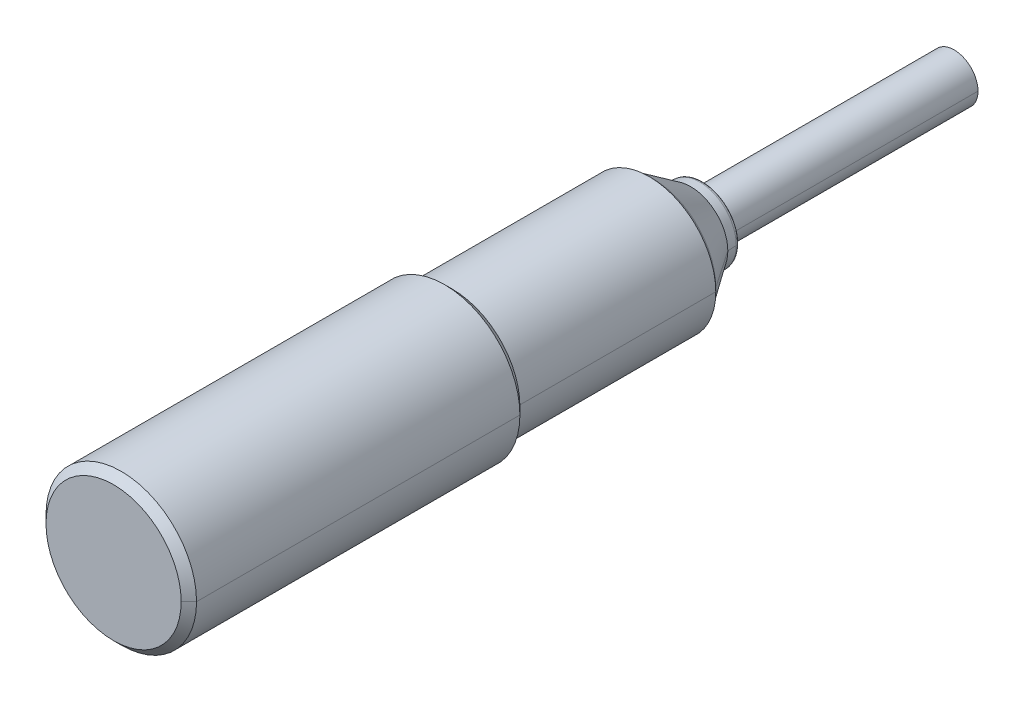
ISO-10303-21;
HEADER;
FILE_DESCRIPTION(('STEP AP214'),'2;1');
FILE_NAME('part.step','',(''),(''),'','','');
FILE_SCHEMA(('AUTOMOTIVE_DESIGN { 1 0 10303 214 1 1 1 1 }'));
ENDSEC;
DATA;
#1=APPLICATION_CONTEXT('core data for automotive mechanical design processes');
#2=APPLICATION_PROTOCOL_DEFINITION('international standard','automotive_design',2000,#1);
#3=PRODUCT_CONTEXT('',#1,'mechanical');
#4=PRODUCT('Part','Part','',(#3));
#5=PRODUCT_RELATED_PRODUCT_CATEGORY('part','',(#4));
#6=PRODUCT_DEFINITION_FORMATION('','',#4);
#7=PRODUCT_DEFINITION_CONTEXT('part definition',#1,'design');
#8=PRODUCT_DEFINITION('design','',#6,#7);
#9=PRODUCT_DEFINITION_SHAPE('','',#8);
#10=(LENGTH_UNIT() NAMED_UNIT(*) SI_UNIT(.MILLI.,.METRE.));
#11=(NAMED_UNIT(*) PLANE_ANGLE_UNIT() SI_UNIT($,.RADIAN.));
#12=(NAMED_UNIT(*) SI_UNIT($,.STERADIAN.) SOLID_ANGLE_UNIT());
#13=UNCERTAINTY_MEASURE_WITH_UNIT(LENGTH_MEASURE(1.E-05),#10,'distance_accuracy_value','');
#14=(GEOMETRIC_REPRESENTATION_CONTEXT(3) GLOBAL_UNCERTAINTY_ASSIGNED_CONTEXT((#13)) GLOBAL_UNIT_ASSIGNED_CONTEXT((#10,
#11,#12)) REPRESENTATION_CONTEXT('',''));
#15=CARTESIAN_POINT('',(0.,0.,0.));
#16=DIRECTION('',(0.,0.,1.));
#17=DIRECTION('',(1.,0.,0.));
#18=AXIS2_PLACEMENT_3D('',#15,#16,#17);
#19=CARTESIAN_POINT('',(0.,0.,0.));
#20=DIRECTION('',(0.,0.,-1.));
#21=DIRECTION('',(-1.,0.,0.));
#22=AXIS2_PLACEMENT_3D('',#19,#20,#21);
#23=PLANE('',#22);
#24=CARTESIAN_POINT('',(0.,0.,0.));
#25=DIRECTION('',(0.,0.,-1.));
#26=DIRECTION('',(-1.,0.,0.));
#27=AXIS2_PLACEMENT_3D('',#24,#25,#26);
#28=CIRCLE('',#27,5.3865);
#29=CARTESIAN_POINT('',(5.3865,0.,0.));
#30=VERTEX_POINT('',#29);
#31=CARTESIAN_POINT('',(-5.3865,0.,0.));
#32=VERTEX_POINT('',#31);
#33=EDGE_CURVE('E10',#30,#32,#28,.T.);
#34=ORIENTED_EDGE('',*,*,#33,.F.);
#35=CARTESIAN_POINT('',(0.,0.,0.));
#36=DIRECTION('',(0.,0.,-1.));
#37=DIRECTION('',(-1.,0.,0.));
#38=AXIS2_PLACEMENT_3D('',#35,#36,#37);
#39=CIRCLE('',#38,5.3865);
#40=EDGE_CURVE('E24',#32,#30,#39,.T.);
#41=ORIENTED_EDGE('',*,*,#40,.F.);
#42=EDGE_LOOP('',(#34,#41));
#43=FACE_BOUND('',#42,.T.);
#44=ADVANCED_FACE('F16',(#43),#23,.F.);
#45=CARTESIAN_POINT('',(0.,0.,0.));
#46=DIRECTION('',(0.,0.,-1.));
#47=DIRECTION('',(0.,-1.,0.));
#48=AXIS2_PLACEMENT_3D('',#45,#46,#47);
#49=CONICAL_SURFACE('',#48,5.3865,0.785398163397446);
#50=DIRECTION('',(0.707106781186546,0.,-0.707106781186549));
#51=VECTOR('',#50,1.);
#52=CARTESIAN_POINT('',(5.3865,0.,0.));
#53=LINE('',#52,#51);
#54=CARTESIAN_POINT('',(6.,0.,-0.6135));
#55=VERTEX_POINT('',#54);
#56=EDGE_CURVE('E342',#30,#55,#53,.T.);
#57=ORIENTED_EDGE('',*,*,#56,.T.);
#58=CARTESIAN_POINT('',(0.,0.,-0.6135));
#59=DIRECTION('',(0.,0.,-1.));
#60=DIRECTION('',(-1.,0.,0.));
#61=AXIS2_PLACEMENT_3D('',#58,#59,#60);
#62=CIRCLE('',#61,6.);
#63=CARTESIAN_POINT('',(-6.,0.,-0.6135));
#64=VERTEX_POINT('',#63);
#65=EDGE_CURVE('E337',#64,#55,#62,.T.);
#66=ORIENTED_EDGE('',*,*,#65,.F.);
#67=DIRECTION('',(-0.707106781186546,0.,-0.707106781186549));
#68=VECTOR('',#67,1.);
#69=CARTESIAN_POINT('',(-5.3865,0.,0.));
#70=LINE('',#69,#68);
#71=EDGE_CURVE('E332',#32,#64,#70,.T.);
#72=ORIENTED_EDGE('',*,*,#71,.F.);
#73=ORIENTED_EDGE('',*,*,#40,.T.);
#74=EDGE_LOOP('',(#57,#66,#72,#73));
#75=FACE_BOUND('',#74,.T.);
#76=ADVANCED_FACE('F351',(#75),#49,.T.);
#77=CARTESIAN_POINT('',(0.,0.,0.));
#78=DIRECTION('',(0.,0.,-1.));
#79=DIRECTION('',(0.,1.,0.));
#80=AXIS2_PLACEMENT_3D('',#77,#78,#79);
#81=CONICAL_SURFACE('',#80,5.3865,0.785398163397446);
#82=ORIENTED_EDGE('',*,*,#56,.F.);
#83=ORIENTED_EDGE('',*,*,#33,.T.);
#84=ORIENTED_EDGE('',*,*,#71,.T.);
#85=CARTESIAN_POINT('',(0.,0.,-0.6135));
#86=DIRECTION('',(0.,0.,-1.));
#87=DIRECTION('',(-1.,0.,0.));
#88=AXIS2_PLACEMENT_3D('',#85,#86,#87);
#89=CIRCLE('',#88,6.);
#90=EDGE_CURVE('E327',#55,#64,#89,.T.);
#91=ORIENTED_EDGE('',*,*,#90,.F.);
#92=EDGE_LOOP('',(#82,#83,#84,#91));
#93=FACE_BOUND('',#92,.T.);
#94=ADVANCED_FACE('F354',(#93),#81,.T.);
#95=CARTESIAN_POINT('',(0.,0.,-67.));
#96=DIRECTION('',(0.,0.,-1.));
#97=DIRECTION('',(0.,1.,0.));
#98=AXIS2_PLACEMENT_3D('',#95,#96,#97);
#99=CYLINDRICAL_SURFACE('',#98,6.);
#100=DIRECTION('',(0.,0.,-1.));
#101=VECTOR('',#100,1.);
#102=CARTESIAN_POINT('',(6.,0.,-0.613500000000002));
#103=LINE('',#102,#101);
#104=CARTESIAN_POINT('',(6.,0.,-26.3865));
#105=VERTEX_POINT('',#104);
#106=EDGE_CURVE('E322',#55,#105,#103,.T.);
#107=ORIENTED_EDGE('',*,*,#106,.F.);
#108=ORIENTED_EDGE('',*,*,#90,.T.);
#109=DIRECTION('',(0.,0.,-1.));
#110=VECTOR('',#109,1.);
#111=CARTESIAN_POINT('',(-6.,0.,-0.613500000000002));
#112=LINE('',#111,#110);
#113=CARTESIAN_POINT('',(-6.,0.,-26.3865));
#114=VERTEX_POINT('',#113);
#115=EDGE_CURVE('E318',#64,#114,#112,.T.);
#116=ORIENTED_EDGE('',*,*,#115,.T.);
#117=CARTESIAN_POINT('',(0.,0.,-26.3865));
#118=DIRECTION('',(0.,0.,-1.));
#119=DIRECTION('',(-1.,0.,0.));
#120=AXIS2_PLACEMENT_3D('',#117,#118,#119);
#121=CIRCLE('',#120,6.);
#122=EDGE_CURVE('E313',#105,#114,#121,.T.);
#123=ORIENTED_EDGE('',*,*,#122,.F.);
#124=EDGE_LOOP('',(#107,#108,#116,#123));
#125=FACE_BOUND('',#124,.T.);
#126=ADVANCED_FACE('F358',(#125),#99,.T.);
#127=CARTESIAN_POINT('',(0.,0.,-26.3865));
#128=DIRECTION('',(0.,0.,1.));
#129=DIRECTION('',(0.,1.,0.));
#130=AXIS2_PLACEMENT_3D('',#127,#128,#129);
#131=CONICAL_SURFACE('',#130,6.,0.785398163397457);
#132=DIRECTION('',(-0.707106781186554,0.,0.707106781186541));
#133=VECTOR('',#132,1.);
#134=CARTESIAN_POINT('',(-5.38649999999999,0.,-27.));
#135=LINE('',#134,#133);
#136=CARTESIAN_POINT('',(-5.3865,0.,-27.));
#137=VERTEX_POINT('',#136);
#138=EDGE_CURVE('E308',#137,#114,#135,.T.);
#139=ORIENTED_EDGE('',*,*,#138,.F.);
#140=CARTESIAN_POINT('',(0.,0.,-27.));
#141=DIRECTION('',(0.,0.,-1.));
#142=DIRECTION('',(-1.,0.,0.));
#143=AXIS2_PLACEMENT_3D('',#140,#141,#142);
#144=CIRCLE('',#143,5.3865);
#145=CARTESIAN_POINT('',(5.38649999999999,0.,-27.));
#146=VERTEX_POINT('',#145);
#147=EDGE_CURVE('E303',#146,#137,#144,.T.);
#148=ORIENTED_EDGE('',*,*,#147,.F.);
#149=DIRECTION('',(0.707106781186554,0.,0.707106781186541));
#150=VECTOR('',#149,1.);
#151=CARTESIAN_POINT('',(5.38649999999999,0.,-27.));
#152=LINE('',#151,#150);
#153=EDGE_CURVE('E298',#146,#105,#152,.T.);
#154=ORIENTED_EDGE('',*,*,#153,.T.);
#155=ORIENTED_EDGE('',*,*,#122,.T.);
#156=EDGE_LOOP('',(#139,#148,#154,#155));
#157=FACE_BOUND('',#156,.T.);
#158=ADVANCED_FACE('F367',(#157),#131,.T.);
#159=CARTESIAN_POINT('',(0.,0.,-26.3865));
#160=DIRECTION('',(0.,0.,1.));
#161=DIRECTION('',(0.,-1.,0.));
#162=AXIS2_PLACEMENT_3D('',#159,#160,#161);
#163=CONICAL_SURFACE('',#162,6.,0.785398163397457);
#164=ORIENTED_EDGE('',*,*,#138,.T.);
#165=CARTESIAN_POINT('',(0.,0.,-26.3865));
#166=DIRECTION('',(0.,0.,-1.));
#167=DIRECTION('',(-1.,0.,0.));
#168=AXIS2_PLACEMENT_3D('',#165,#166,#167);
#169=CIRCLE('',#168,6.);
#170=EDGE_CURVE('E293',#114,#105,#169,.T.);
#171=ORIENTED_EDGE('',*,*,#170,.T.);
#172=ORIENTED_EDGE('',*,*,#153,.F.);
#173=CARTESIAN_POINT('',(0.,0.,-27.));
#174=DIRECTION('',(0.,0.,-1.));
#175=DIRECTION('',(-1.,0.,0.));
#176=AXIS2_PLACEMENT_3D('',#173,#174,#175);
#177=CIRCLE('',#176,5.3865);
#178=EDGE_CURVE('E288',#137,#146,#177,.T.);
#179=ORIENTED_EDGE('',*,*,#178,.F.);
#180=EDGE_LOOP('',(#164,#171,#172,#179));
#181=FACE_BOUND('',#180,.T.);
#182=ADVANCED_FACE('F365',(#181),#163,.T.);
#183=CARTESIAN_POINT('',(0.,5.3865,-27.));
#184=DIRECTION('',(0.,0.,1.));
#185=DIRECTION('',(1.,0.,0.));
#186=AXIS2_PLACEMENT_3D('',#183,#184,#185);
#187=PLANE('',#186);
#188=CARTESIAN_POINT('',(0.,0.,-27.));
#189=DIRECTION('',(0.,0.,-1.));
#190=DIRECTION('',(-1.,0.,0.));
#191=AXIS2_PLACEMENT_3D('',#188,#189,#190);
#192=CIRCLE('',#191,5.3);
#193=CARTESIAN_POINT('',(5.3,0.,-27.));
#194=VERTEX_POINT('',#193);
#195=CARTESIAN_POINT('',(-5.3,0.,-27.));
#196=VERTEX_POINT('',#195);
#197=EDGE_CURVE('E283',#194,#196,#192,.T.);
#198=ORIENTED_EDGE('',*,*,#197,.F.);
#199=CARTESIAN_POINT('',(0.,0.,-27.));
#200=DIRECTION('',(0.,0.,-1.));
#201=DIRECTION('',(-1.,0.,0.));
#202=AXIS2_PLACEMENT_3D('',#199,#200,#201);
#203=CIRCLE('',#202,5.3);
#204=EDGE_CURVE('E278',#196,#194,#203,.T.);
#205=ORIENTED_EDGE('',*,*,#204,.F.);
#206=EDGE_LOOP('',(#198,#205));
#207=FACE_BOUND('',#206,.T.);
#208=ORIENTED_EDGE('',*,*,#178,.T.);
#209=ORIENTED_EDGE('',*,*,#147,.T.);
#210=EDGE_LOOP('',(#208,#209));
#211=FACE_BOUND('',#210,.T.);
#212=ADVANCED_FACE('F369',(#207,#211),#187,.F.);
#213=CARTESIAN_POINT('',(0.,0.,-67.));
#214=DIRECTION('',(0.,0.,-1.));
#215=DIRECTION('',(0.,-1.,0.));
#216=AXIS2_PLACEMENT_3D('',#213,#214,#215);
#217=CYLINDRICAL_SURFACE('',#216,5.3);
#218=DIRECTION('',(0.,0.,-1.));
#219=VECTOR('',#218,1.);
#220=CARTESIAN_POINT('',(5.3,0.,-27.));
#221=LINE('',#220,#219);
#222=CARTESIAN_POINT('',(5.3,0.,-42.7));
#223=VERTEX_POINT('',#222);
#224=EDGE_CURVE('E274',#194,#223,#221,.T.);
#225=ORIENTED_EDGE('',*,*,#224,.T.);
#226=CARTESIAN_POINT('',(0.,0.,-42.7));
#227=DIRECTION('',(0.,0.,-1.));
#228=DIRECTION('',(-1.,0.,0.));
#229=AXIS2_PLACEMENT_3D('',#226,#227,#228);
#230=CIRCLE('',#229,5.3);
#231=CARTESIAN_POINT('',(-5.3,0.,-42.7));
#232=VERTEX_POINT('',#231);
#233=EDGE_CURVE('E269',#232,#223,#230,.T.);
#234=ORIENTED_EDGE('',*,*,#233,.F.);
#235=DIRECTION('',(0.,0.,-1.));
#236=VECTOR('',#235,1.);
#237=CARTESIAN_POINT('',(-5.3,0.,-27.));
#238=LINE('',#237,#236);
#239=EDGE_CURVE('E264',#196,#232,#238,.T.);
#240=ORIENTED_EDGE('',*,*,#239,.F.);
#241=ORIENTED_EDGE('',*,*,#204,.T.);
#242=EDGE_LOOP('',(#225,#234,#240,#241));
#243=FACE_BOUND('',#242,.T.);
#244=ADVANCED_FACE('F371',(#243),#217,.T.);
#245=CARTESIAN_POINT('',(0.,0.,-67.));
#246=DIRECTION('',(0.,0.,-1.));
#247=DIRECTION('',(0.,1.,0.));
#248=AXIS2_PLACEMENT_3D('',#245,#246,#247);
#249=CYLINDRICAL_SURFACE('',#248,5.3);
#250=ORIENTED_EDGE('',*,*,#224,.F.);
#251=ORIENTED_EDGE('',*,*,#197,.T.);
#252=ORIENTED_EDGE('',*,*,#239,.T.);
#253=CARTESIAN_POINT('',(0.,0.,-42.7));
#254=DIRECTION('',(0.,0.,-1.));
#255=DIRECTION('',(-1.,0.,0.));
#256=AXIS2_PLACEMENT_3D('',#253,#254,#255);
#257=CIRCLE('',#256,5.3);
#258=EDGE_CURVE('E259',#223,#232,#257,.T.);
#259=ORIENTED_EDGE('',*,*,#258,.F.);
#260=EDGE_LOOP('',(#250,#251,#252,#259));
#261=FACE_BOUND('',#260,.T.);
#262=ADVANCED_FACE('F379',(#261),#249,.T.);
#263=CARTESIAN_POINT('',(0.,0.,-42.7));
#264=DIRECTION('',(0.,0.,1.));
#265=DIRECTION('',(0.,1.,0.));
#266=AXIS2_PLACEMENT_3D('',#263,#264,#265);
#267=CONICAL_SURFACE('',#266,5.3,0.785398163397446);
#268=DIRECTION('',(-0.707106781186548,0.,0.707106781186548));
#269=VECTOR('',#268,1.);
#270=CARTESIAN_POINT('',(-5.,0.,-43.));
#271=LINE('',#270,#269);
#272=CARTESIAN_POINT('',(-5.,0.,-43.));
#273=VERTEX_POINT('',#272);
#274=EDGE_CURVE('E254',#273,#232,#271,.T.);
#275=ORIENTED_EDGE('',*,*,#274,.F.);
#276=CARTESIAN_POINT('',(0.,0.,-43.));
#277=DIRECTION('',(0.,0.,-1.));
#278=DIRECTION('',(-1.,0.,0.));
#279=AXIS2_PLACEMENT_3D('',#276,#277,#278);
#280=CIRCLE('',#279,5.);
#281=CARTESIAN_POINT('',(5.,0.,-43.));
#282=VERTEX_POINT('',#281);
#283=EDGE_CURVE('E249',#282,#273,#280,.T.);
#284=ORIENTED_EDGE('',*,*,#283,.F.);
#285=DIRECTION('',(0.707106781186548,0.,0.707106781186548));
#286=VECTOR('',#285,1.);
#287=CARTESIAN_POINT('',(5.,0.,-43.));
#288=LINE('',#287,#286);
#289=EDGE_CURVE('E244',#282,#223,#288,.T.);
#290=ORIENTED_EDGE('',*,*,#289,.T.);
#291=ORIENTED_EDGE('',*,*,#258,.T.);
#292=EDGE_LOOP('',(#275,#284,#290,#291));
#293=FACE_BOUND('',#292,.T.);
#294=ADVANCED_FACE('F427',(#293),#267,.T.);
#295=CARTESIAN_POINT('',(0.,0.,-42.7));
#296=DIRECTION('',(0.,0.,1.));
#297=DIRECTION('',(0.,-1.,0.));
#298=AXIS2_PLACEMENT_3D('',#295,#296,#297);
#299=CONICAL_SURFACE('',#298,5.3,0.785398163397446);
#300=ORIENTED_EDGE('',*,*,#274,.T.);
#301=ORIENTED_EDGE('',*,*,#233,.T.);
#302=ORIENTED_EDGE('',*,*,#289,.F.);
#303=CARTESIAN_POINT('',(0.,0.,-43.));
#304=DIRECTION('',(0.,0.,-1.));
#305=DIRECTION('',(-1.,0.,0.));
#306=AXIS2_PLACEMENT_3D('',#303,#304,#305);
#307=CIRCLE('',#306,5.);
#308=EDGE_CURVE('E239',#273,#282,#307,.T.);
#309=ORIENTED_EDGE('',*,*,#308,.F.);
#310=EDGE_LOOP('',(#300,#301,#302,#309));
#311=FACE_BOUND('',#310,.T.);
#312=ADVANCED_FACE('F437',(#311),#299,.T.);
#313=CARTESIAN_POINT('',(0.,0.,-43.));
#314=DIRECTION('',(0.,0.,1.));
#315=DIRECTION('',(0.,-1.,0.));
#316=AXIS2_PLACEMENT_3D('',#313,#314,#315);
#317=CONICAL_SURFACE('',#316,5.,0.597251670032467);
#318=DIRECTION('',(-0.562372049186204,0.,0.826884319777627));
#319=VECTOR('',#318,1.);
#320=CARTESIAN_POINT('',(-2.9596708908299,0.,-46.));
#321=LINE('',#320,#319);
#322=CARTESIAN_POINT('',(-2.9596708908299,0.,-46.));
#323=VERTEX_POINT('',#322);
#324=EDGE_CURVE('E234',#323,#273,#321,.T.);
#325=ORIENTED_EDGE('',*,*,#324,.T.);
#326=ORIENTED_EDGE('',*,*,#308,.T.);
#327=DIRECTION('',(0.562372049186204,0.,0.826884319777627));
#328=VECTOR('',#327,1.);
#329=CARTESIAN_POINT('',(2.9596708908299,0.,-46.));
#330=LINE('',#329,#328);
#331=CARTESIAN_POINT('',(2.9596708908299,0.,-46.));
#332=VERTEX_POINT('',#331);
#333=EDGE_CURVE('E229',#332,#282,#330,.T.);
#334=ORIENTED_EDGE('',*,*,#333,.F.);
#335=CARTESIAN_POINT('',(0.,0.,-46.));
#336=DIRECTION('',(0.,0.,-1.));
#337=DIRECTION('',(-1.,0.,0.));
#338=AXIS2_PLACEMENT_3D('',#335,#336,#337);
#339=CIRCLE('',#338,2.9596708908299);
#340=EDGE_CURVE('E224',#323,#332,#339,.T.);
#341=ORIENTED_EDGE('',*,*,#340,.F.);
#342=EDGE_LOOP('',(#325,#326,#334,#341));
#343=FACE_BOUND('',#342,.T.);
#344=ADVANCED_FACE('F447',(#343),#317,.T.);
#345=CARTESIAN_POINT('',(0.,0.,-46.));
#346=DIRECTION('',(0.,0.,1.));
#347=DIRECTION('',(0.,-1.,0.));
#348=AXIS2_PLACEMENT_3D('',#345,#346,#347);
#349=CONICAL_SURFACE('',#348,2.9596708908299,0.0596002200534987);
#350=DIRECTION('',(-0.0595649411397777,0.,0.998224432573665));
#351=VECTOR('',#350,1.);
#352=CARTESIAN_POINT('',(-2.916834979319,0.,-46.717869482342));
#353=LINE('',#352,#351);
#354=CARTESIAN_POINT('',(-2.916834979319,0.,-46.717869482342));
#355=VERTEX_POINT('',#354);
#356=EDGE_CURVE('E219',#355,#323,#353,.T.);
#357=ORIENTED_EDGE('',*,*,#356,.T.);
#358=ORIENTED_EDGE('',*,*,#340,.T.);
#359=DIRECTION('',(0.0595649411397777,0.,0.998224432573665));
#360=VECTOR('',#359,1.);
#361=CARTESIAN_POINT('',(2.916834979319,0.,-46.717869482342));
#362=LINE('',#361,#360);
#363=CARTESIAN_POINT('',(2.916834979319,0.,-46.717869482342));
#364=VERTEX_POINT('',#363);
#365=EDGE_CURVE('E214',#364,#332,#362,.T.);
#366=ORIENTED_EDGE('',*,*,#365,.F.);
#367=CARTESIAN_POINT('',(0.,0.,-46.717869482342));
#368=DIRECTION('',(0.,0.,-1.));
#369=DIRECTION('',(-1.,0.,0.));
#370=AXIS2_PLACEMENT_3D('',#367,#368,#369);
#371=CIRCLE('',#370,2.916834979319);
#372=CARTESIAN_POINT('',(0.901351578396863,2.77407491403895,-46.717869482342));
#373=VERTEX_POINT('',#372);
#374=EDGE_CURVE('E209',#373,#364,#371,.T.);
#375=ORIENTED_EDGE('',*,*,#374,.F.);
#376=CARTESIAN_POINT('',(0.,0.,-46.717869482342));
#377=DIRECTION('',(0.,0.,-1.));
#378=DIRECTION('',(-1.,0.,0.));
#379=AXIS2_PLACEMENT_3D('',#376,#377,#378);
#380=CIRCLE('',#379,2.916834979319);
#381=EDGE_CURVE('E204',#355,#373,#380,.T.);
#382=ORIENTED_EDGE('',*,*,#381,.F.);
#383=EDGE_LOOP('',(#357,#358,#366,#375,#382));
#384=FACE_BOUND('',#383,.T.);
#385=ADVANCED_FACE('F175',(#384),#349,.T.);
#386=CARTESIAN_POINT('',(0.,0.,-46.7));
#387=DIRECTION('',(0.,0.,-1.));
#388=DIRECTION('',(0.951056516295154,-0.309016994374947,0.));
#389=AXIS2_PLACEMENT_3D('',#386,#387,#388);
#390=TOROIDAL_SURFACE('',#389,2.61736764954721,0.29999999999967);
#391=CARTESIAN_POINT('',(-0.808811084237301,-2.48926455864201,-46.7));
#392=DIRECTION('',(-0.951056516295154,0.309016994374947,0.));
#393=DIRECTION('',(0.,0.,-1.));
#394=AXIS2_PLACEMENT_3D('',#391,#392,#393);
#395=CIRCLE('',#394,0.29999999999967);
#396=CARTESIAN_POINT('',(-0.808811084237301,-2.48926455864201,-46.9999999999997));
#397=VERTEX_POINT('',#396);
#398=CARTESIAN_POINT('',(-0.901351578396862,-2.77407491403895,-46.717869482342));
#399=VERTEX_POINT('',#398);
#400=EDGE_CURVE('E200',#397,#399,#395,.T.);
#401=ORIENTED_EDGE('',*,*,#400,.T.);
#402=CARTESIAN_POINT('',(0.,0.,-46.717869482342));
#403=DIRECTION('',(0.,0.,-1.));
#404=DIRECTION('',(-1.,0.,0.));
#405=AXIS2_PLACEMENT_3D('',#402,#403,#404);
#406=CIRCLE('',#405,2.916834979319);
#407=EDGE_CURVE('E195',#399,#355,#406,.T.);
#408=ORIENTED_EDGE('',*,*,#407,.T.);
#409=ORIENTED_EDGE('',*,*,#381,.T.);
#410=CARTESIAN_POINT('',(0.808811084237301,2.48926455864201,-46.7));
#411=DIRECTION('',(0.951056516295154,-0.309016994374947,0.));
#412=DIRECTION('',(0.,0.,-1.));
#413=AXIS2_PLACEMENT_3D('',#410,#411,#412);
#414=CIRCLE('',#413,0.29999999999967);
#415=CARTESIAN_POINT('',(0.808811084237301,2.48926455864201,-46.9999999999997));
#416=VERTEX_POINT('',#415);
#417=EDGE_CURVE('E192',#416,#373,#414,.T.);
#418=ORIENTED_EDGE('',*,*,#417,.F.);
#419=CARTESIAN_POINT('',(-0.808811084237203,-2.48926455864171,-47.));
#420=CARTESIAN_POINT('',(-1.59048885550696,-2.23493089535044,-47.));
#421=CARTESIAN_POINT('',(-2.27452528969776,-1.67500414516168,-47.));
#422=CARTESIAN_POINT('',(-2.69121829726129,-0.855110234126054,-47.));
#423=CARTESIAN_POINT('',(-2.795609891976,0.908348716886556,-47.));
#424=CARTESIAN_POINT('',(-1.67462015335354,2.27365713730176,-47.));
#425=CARTESIAN_POINT('',(-0.85558687944629,2.69203924033491,-47.));
#426=CARTESIAN_POINT('',(0.0269269067107043,2.74296296879463,-47.));
#427=CARTESIAN_POINT('',(0.808811084237203,2.48926455864171,-47.));
#428=B_SPLINE_CURVE_WITH_KNOTS('',5,(#419,#420,#421,#422,#423,#424,#425,#426,#427),
.UNSPECIFIED.,.F.,.F.,(6,3,6),(0.,1.5707963267949,3.14159265358979),.UNSPECIFIED.);
#429=EDGE_CURVE('E191',#397,#416,#428,.T.);
#430=ORIENTED_EDGE('',*,*,#429,.F.);
#431=EDGE_LOOP('',(#401,#408,#409,#418,#430));
#432=FACE_BOUND('',#431,.T.);
#433=ADVANCED_FACE('F169',(#432),#390,.T.);
#434=CARTESIAN_POINT('',(0.,2.6173676495469,-47.));
#435=DIRECTION('',(0.,0.,1.));
#436=DIRECTION('',(1.,0.,0.));
#437=AXIS2_PLACEMENT_3D('',#434,#435,#436);
#438=PLANE('',#437);
#439=CARTESIAN_POINT('',(0.,0.,-47.));
#440=DIRECTION('',(0.,0.,-1.));
#441=DIRECTION('',(-1.,0.,0.));
#442=AXIS2_PLACEMENT_3D('',#439,#440,#441);
#443=CIRCLE('',#442,1.9);
#444=CARTESIAN_POINT('',(1.9,0.,-47.));
#445=VERTEX_POINT('',#444);
#446=CARTESIAN_POINT('',(-1.9,0.,-47.));
#447=VERTEX_POINT('',#446);
#448=EDGE_CURVE('E122',#445,#447,#443,.T.);
#449=ORIENTED_EDGE('',*,*,#448,.F.);
#450=CARTESIAN_POINT('',(0.,0.,-47.));
#451=DIRECTION('',(0.,0.,-1.));
#452=DIRECTION('',(-1.,0.,0.));
#453=AXIS2_PLACEMENT_3D('',#450,#451,#452);
#454=CIRCLE('',#453,1.9);
#455=EDGE_CURVE('E149',#447,#445,#454,.T.);
#456=ORIENTED_EDGE('',*,*,#455,.F.);
#457=EDGE_LOOP('',(#449,#456));
#458=FACE_BOUND('',#457,.T.);
#459=ORIENTED_EDGE('',*,*,#429,.T.);
#460=CARTESIAN_POINT('',(0.,0.,-47.));
#461=DIRECTION('',(0.,0.,-1.));
#462=DIRECTION('',(-1.,0.,0.));
#463=AXIS2_PLACEMENT_3D('',#460,#461,#462);
#464=CIRCLE('',#463,2.6173676495469);
#465=EDGE_CURVE('E144',#416,#397,#464,.T.);
#466=ORIENTED_EDGE('',*,*,#465,.T.);
#467=EDGE_LOOP('',(#459,#466));
#468=FACE_BOUND('',#467,.T.);
#469=ADVANCED_FACE('F158',(#458,#468),#438,.F.);
#470=CARTESIAN_POINT('',(0.,0.,-46.7));
#471=DIRECTION('',(0.,0.,-1.));
#472=DIRECTION('',(-0.951056516295154,0.309016994374947,0.));
#473=AXIS2_PLACEMENT_3D('',#470,#471,#472);
#474=TOROIDAL_SURFACE('',#473,2.61736764954721,0.29999999999967);
#475=ORIENTED_EDGE('',*,*,#400,.F.);
#476=ORIENTED_EDGE('',*,*,#465,.F.);
#477=ORIENTED_EDGE('',*,*,#417,.T.);
#478=ORIENTED_EDGE('',*,*,#374,.T.);
#479=CARTESIAN_POINT('',(0.,0.,-46.717869482342));
#480=DIRECTION('',(0.,0.,-1.));
#481=DIRECTION('',(-1.,0.,0.));
#482=AXIS2_PLACEMENT_3D('',#479,#480,#481);
#483=CIRCLE('',#482,2.916834979319);
#484=EDGE_CURVE('E139',#364,#399,#483,.T.);
#485=ORIENTED_EDGE('',*,*,#484,.T.);
#486=EDGE_LOOP('',(#475,#476,#477,#478,#485));
#487=FACE_BOUND('',#486,.T.);
#488=ADVANCED_FACE('F168',(#487),#474,.T.);
#489=CARTESIAN_POINT('',(0.,0.,-46.));
#490=DIRECTION('',(0.,0.,1.));
#491=DIRECTION('',(0.,1.,0.));
#492=AXIS2_PLACEMENT_3D('',#489,#490,#491);
#493=CONICAL_SURFACE('',#492,2.9596708908299,0.0596002200534987);
#494=ORIENTED_EDGE('',*,*,#356,.F.);
#495=ORIENTED_EDGE('',*,*,#407,.F.);
#496=ORIENTED_EDGE('',*,*,#484,.F.);
#497=ORIENTED_EDGE('',*,*,#365,.T.);
#498=CARTESIAN_POINT('',(0.,0.,-46.));
#499=DIRECTION('',(0.,0.,-1.));
#500=DIRECTION('',(-1.,0.,0.));
#501=AXIS2_PLACEMENT_3D('',#498,#499,#500);
#502=CIRCLE('',#501,2.9596708908299);
#503=EDGE_CURVE('E134',#332,#323,#502,.T.);
#504=ORIENTED_EDGE('',*,*,#503,.T.);
#505=EDGE_LOOP('',(#494,#495,#496,#497,#504));
#506=FACE_BOUND('',#505,.T.);
#507=ADVANCED_FACE('F485',(#506),#493,.T.);
#508=CARTESIAN_POINT('',(0.,0.,-43.));
#509=DIRECTION('',(0.,0.,1.));
#510=DIRECTION('',(0.,1.,0.));
#511=AXIS2_PLACEMENT_3D('',#508,#509,#510);
#512=CONICAL_SURFACE('',#511,5.,0.597251670032467);
#513=ORIENTED_EDGE('',*,*,#324,.F.);
#514=ORIENTED_EDGE('',*,*,#503,.F.);
#515=ORIENTED_EDGE('',*,*,#333,.T.);
#516=ORIENTED_EDGE('',*,*,#283,.T.);
#517=EDGE_LOOP('',(#513,#514,#515,#516));
#518=FACE_BOUND('',#517,.T.);
#519=ADVANCED_FACE('F494',(#518),#512,.T.);
#520=CARTESIAN_POINT('',(0.,0.,-67.));
#521=DIRECTION('',(0.,0.,-1.));
#522=DIRECTION('',(0.,-1.,0.));
#523=AXIS2_PLACEMENT_3D('',#520,#521,#522);
#524=CYLINDRICAL_SURFACE('',#523,1.9);
#525=DIRECTION('',(0.,0.,-1.));
#526=VECTOR('',#525,1.);
#527=CARTESIAN_POINT('',(1.9,0.,-47.));
#528=LINE('',#527,#526);
#529=CARTESIAN_POINT('',(1.9,0.,-67.));
#530=VERTEX_POINT('',#529);
#531=EDGE_CURVE('E114',#445,#530,#528,.T.);
#532=ORIENTED_EDGE('',*,*,#531,.T.);
#533=CARTESIAN_POINT('',(0.,0.,-67.));
#534=DIRECTION('',(0.,0.,-1.));
#535=DIRECTION('',(-1.,0.,0.));
#536=AXIS2_PLACEMENT_3D('',#533,#534,#535);
#537=CIRCLE('',#536,1.9);
#538=CARTESIAN_POINT('',(-1.9,0.,-67.));
#539=VERTEX_POINT('',#538);
#540=EDGE_CURVE('E107',#539,#530,#537,.T.);
#541=ORIENTED_EDGE('',*,*,#540,.F.);
#542=DIRECTION('',(0.,0.,-1.));
#543=VECTOR('',#542,1.);
#544=CARTESIAN_POINT('',(-1.9,0.,-47.));
#545=LINE('',#544,#543);
#546=EDGE_CURVE('E111',#447,#539,#545,.T.);
#547=ORIENTED_EDGE('',*,*,#546,.F.);
#548=ORIENTED_EDGE('',*,*,#455,.T.);
#549=EDGE_LOOP('',(#532,#541,#547,#548));
#550=FACE_BOUND('',#549,.T.);
#551=ADVANCED_FACE('F109',(#550),#524,.T.);
#552=CARTESIAN_POINT('',(0.,0.,-67.));
#553=DIRECTION('',(0.,0.,-1.));
#554=DIRECTION('',(0.,1.,0.));
#555=AXIS2_PLACEMENT_3D('',#552,#553,#554);
#556=CYLINDRICAL_SURFACE('',#555,1.9);
#557=ORIENTED_EDGE('',*,*,#531,.F.);
#558=ORIENTED_EDGE('',*,*,#448,.T.);
#559=ORIENTED_EDGE('',*,*,#546,.T.);
#560=CARTESIAN_POINT('',(0.,0.,-67.));
#561=DIRECTION('',(0.,0.,-1.));
#562=DIRECTION('',(-1.,0.,0.));
#563=AXIS2_PLACEMENT_3D('',#560,#561,#562);
#564=CIRCLE('',#563,1.9);
#565=EDGE_CURVE('E121',#530,#539,#564,.T.);
#566=ORIENTED_EDGE('',*,*,#565,.F.);
#567=EDGE_LOOP('',(#557,#558,#559,#566));
#568=FACE_BOUND('',#567,.T.);
#569=ADVANCED_FACE('F120',(#568),#556,.T.);
#570=CARTESIAN_POINT('',(0.,1.9,-67.));
#571=DIRECTION('',(0.,0.,1.));
#572=DIRECTION('',(1.,0.,0.));
#573=AXIS2_PLACEMENT_3D('',#570,#571,#572);
#574=PLANE('',#573);
#575=ORIENTED_EDGE('',*,*,#540,.T.);
#576=ORIENTED_EDGE('',*,*,#565,.T.);
#577=EDGE_LOOP('',(#575,#576));
#578=FACE_BOUND('',#577,.T.);
#579=ADVANCED_FACE('F124',(#578),#574,.F.);
#580=CARTESIAN_POINT('',(0.,0.,-67.));
#581=DIRECTION('',(0.,0.,-1.));
#582=DIRECTION('',(0.,-1.,0.));
#583=AXIS2_PLACEMENT_3D('',#580,#581,#582);
#584=CYLINDRICAL_SURFACE('',#583,6.);
#585=ORIENTED_EDGE('',*,*,#106,.T.);
#586=ORIENTED_EDGE('',*,*,#170,.F.);
#587=ORIENTED_EDGE('',*,*,#115,.F.);
#588=ORIENTED_EDGE('',*,*,#65,.T.);
#589=EDGE_LOOP('',(#585,#586,#587,#588));
#590=FACE_BOUND('',#589,.T.);
#591=ADVANCED_FACE('F361',(#590),#584,.T.);
#592=CLOSED_SHELL('',(#44,#76,#94,#126,#158,#182,#212,#244,#262,#294,#312,#344,#385,#433,#469,
#488,#507,#519,#551,#569,#579,#591));
#593=MANIFOLD_SOLID_BREP('B1',#592);
#594=ADVANCED_BREP_SHAPE_REPRESENTATION('',(#18,#593),#14);
#595=SHAPE_DEFINITION_REPRESENTATION(#9,#594);
ENDSEC;
END-ISO-10303-21;
